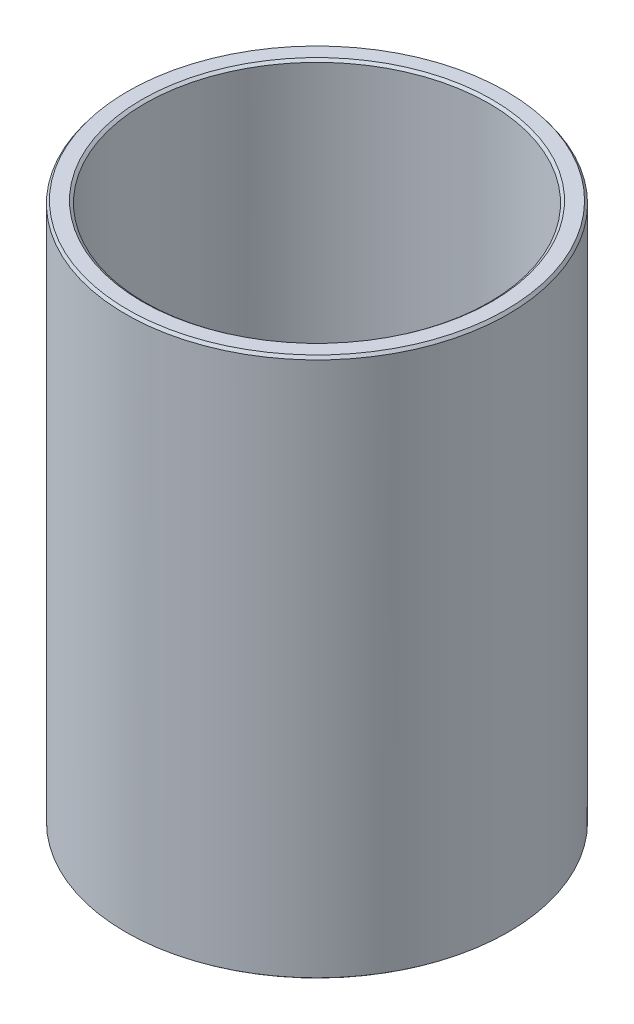
ISO-10303-21;
HEADER;
FILE_DESCRIPTION(('STEP AP214'),'2;1');
FILE_NAME('part.step','',(''),(''),'','','');
FILE_SCHEMA(('AUTOMOTIVE_DESIGN { 1 0 10303 214 1 1 1 1 }'));
ENDSEC;
DATA;
#1=APPLICATION_CONTEXT('core data for automotive mechanical design processes');
#2=APPLICATION_PROTOCOL_DEFINITION('international standard','automotive_design',2000,#1);
#3=PRODUCT_CONTEXT('',#1,'mechanical');
#4=PRODUCT('Part','Part','',(#3));
#5=PRODUCT_RELATED_PRODUCT_CATEGORY('part','',(#4));
#6=PRODUCT_DEFINITION_FORMATION('','',#4);
#7=PRODUCT_DEFINITION_CONTEXT('part definition',#1,'design');
#8=PRODUCT_DEFINITION('design','',#6,#7);
#9=PRODUCT_DEFINITION_SHAPE('','',#8);
#10=(LENGTH_UNIT() NAMED_UNIT(*) SI_UNIT(.MILLI.,.METRE.));
#11=(NAMED_UNIT(*) PLANE_ANGLE_UNIT() SI_UNIT($,.RADIAN.));
#12=(NAMED_UNIT(*) SI_UNIT($,.STERADIAN.) SOLID_ANGLE_UNIT());
#13=UNCERTAINTY_MEASURE_WITH_UNIT(LENGTH_MEASURE(1.E-05),#10,'distance_accuracy_value','');
#14=(GEOMETRIC_REPRESENTATION_CONTEXT(3) GLOBAL_UNCERTAINTY_ASSIGNED_CONTEXT((#13)) GLOBAL_UNIT_ASSIGNED_CONTEXT((#10,
#11,#12)) REPRESENTATION_CONTEXT('',''));
#15=CARTESIAN_POINT('',(0.,0.,0.));
#16=DIRECTION('',(0.,0.,1.));
#17=DIRECTION('',(1.,0.,0.));
#18=AXIS2_PLACEMENT_3D('',#15,#16,#17);
#19=CARTESIAN_POINT('',(0.,155.24099224461,0.));
#20=DIRECTION('',(0.,-1.,0.));
#21=DIRECTION('',(0.,0.,-1.));
#22=AXIS2_PLACEMENT_3D('',#19,#20,#21);
#23=CYLINDRICAL_SURFACE('',#22,55.);
#24=CARTESIAN_POINT('',(0.,0.613129846362109,0.));
#25=DIRECTION('',(0.,1.,0.));
#26=DIRECTION('',(0.,0.,1.));
#27=AXIS2_PLACEMENT_3D('',#24,#25,#26);
#28=CIRCLE('',#27,55.);
#29=CARTESIAN_POINT('',(0.,0.613129846362082,-55.));
#30=VERTEX_POINT('',#29);
#31=EDGE_CURVE('E10',#30,#30,#28,.T.);
#32=CARTESIAN_POINT('',(0.,154.433868409122,0.));
#33=DIRECTION('',(0.,1.,0.));
#34=DIRECTION('',(0.,0.,1.));
#35=AXIS2_PLACEMENT_3D('',#32,#33,#34);
#36=CIRCLE('',#35,55.);
#37=CARTESIAN_POINT('',(0.,154.433868409122,-55.));
#38=VERTEX_POINT('',#37);
#39=EDGE_CURVE('E50',#38,#38,#36,.F.);
#40=CARTESIAN_POINT('',(0.,0.613129846362082,-55.));
#41=CARTESIAN_POINT('',(0.,2.21542920639082,-55.));
#42=CARTESIAN_POINT('',(0.,3.81772856641956,-55.));
#43=CARTESIAN_POINT('',(0.,7.02232728647705,-55.));
#44=CARTESIAN_POINT('',(0.,8.6246266465058,-55.));
#45=CARTESIAN_POINT('',(0.,11.8292253665633,-55.));
#46=CARTESIAN_POINT('',(0.,13.431524726592,-55.));
#47=CARTESIAN_POINT('',(0.,16.6361234466495,-55.));
#48=CARTESIAN_POINT('',(0.,18.2384228066783,-55.));
#49=CARTESIAN_POINT('',(0.,21.4430215267358,-55.));
#50=CARTESIAN_POINT('',(0.,23.0453208867645,-55.));
#51=CARTESIAN_POINT('',(0.,26.249919606822,-55.));
#52=CARTESIAN_POINT('',(0.,27.8522189668507,-55.));
#53=CARTESIAN_POINT('',(0.,31.0568176869082,-55.));
#54=CARTESIAN_POINT('',(0.,32.659117046937,-55.));
#55=CARTESIAN_POINT('',(0.,35.8637157669944,-55.));
#56=CARTESIAN_POINT('',(0.,37.4660151270232,-55.));
#57=CARTESIAN_POINT('',(0.,40.6706138470807,-55.));
#58=CARTESIAN_POINT('',(0.,42.2729132071094,-55.));
#59=CARTESIAN_POINT('',(0.,45.4775119271669,-55.));
#60=CARTESIAN_POINT('',(0.,47.0798112871957,-55.));
#61=CARTESIAN_POINT('',(0.,50.2844100072531,-55.));
#62=CARTESIAN_POINT('',(0.,51.8867093672819,-55.));
#63=CARTESIAN_POINT('',(0.,55.0913080873394,-55.));
#64=CARTESIAN_POINT('',(0.,56.6936074473681,-55.));
#65=CARTESIAN_POINT('',(0.,59.8982061674256,-55.));
#66=CARTESIAN_POINT('',(0.,61.5005055274544,-55.));
#67=CARTESIAN_POINT('',(0.,64.7051042475118,-55.));
#68=CARTESIAN_POINT('',(0.,66.3074036075406,-55.));
#69=CARTESIAN_POINT('',(0.,69.5120023275981,-55.));
#70=CARTESIAN_POINT('',(0.,71.1143016876268,-55.));
#71=CARTESIAN_POINT('',(0.,74.3189004076843,-55.));
#72=CARTESIAN_POINT('',(0.,75.921199767713,-55.));
#73=CARTESIAN_POINT('',(0.,79.1257984877705,-55.));
#74=CARTESIAN_POINT('',(0.,80.7280978477993,-55.));
#75=CARTESIAN_POINT('',(0.,83.9326965678568,-55.));
#76=CARTESIAN_POINT('',(0.,85.5349959278855,-55.));
#77=CARTESIAN_POINT('',(0.,88.739594647943,-55.));
#78=CARTESIAN_POINT('',(0.,90.3418940079718,-55.));
#79=CARTESIAN_POINT('',(0.,93.5464927280292,-55.));
#80=CARTESIAN_POINT('',(0.,95.148792088058,-55.));
#81=CARTESIAN_POINT('',(0.,98.3533908081155,-55.));
#82=CARTESIAN_POINT('',(0.,99.9556901681442,-55.));
#83=CARTESIAN_POINT('',(0.,103.160288888202,-55.));
#84=CARTESIAN_POINT('',(0.,104.76258824823,-55.));
#85=CARTESIAN_POINT('',(0.,107.967186968288,-55.));
#86=CARTESIAN_POINT('',(0.,109.569486328317,-55.));
#87=CARTESIAN_POINT('',(0.,112.774085048374,-55.));
#88=CARTESIAN_POINT('',(0.,114.376384408403,-55.));
#89=CARTESIAN_POINT('',(0.,117.58098312846,-55.));
#90=CARTESIAN_POINT('',(0.,119.183282488489,-55.));
#91=CARTESIAN_POINT('',(0.,122.387881208547,-55.));
#92=CARTESIAN_POINT('',(0.,123.990180568575,-55.));
#93=CARTESIAN_POINT('',(0.,127.194779288633,-55.));
#94=CARTESIAN_POINT('',(0.,128.797078648662,-55.));
#95=CARTESIAN_POINT('',(0.,132.001677368719,-55.));
#96=CARTESIAN_POINT('',(0.,133.603976728748,-55.));
#97=CARTESIAN_POINT('',(0.,136.808575448805,-55.));
#98=CARTESIAN_POINT('',(0.,138.410874808834,-55.));
#99=CARTESIAN_POINT('',(0.,141.615473528892,-55.));
#100=CARTESIAN_POINT('',(0.,143.21777288892,-55.));
#101=CARTESIAN_POINT('',(0.,146.422371608978,-55.));
#102=CARTESIAN_POINT('',(0.,148.024670969007,-55.));
#103=CARTESIAN_POINT('',(0.,151.229269689064,-55.));
#104=CARTESIAN_POINT('',(0.,152.831569049093,-55.));
#105=CARTESIAN_POINT('',(0.,154.433868409122,-55.));
#106=B_SPLINE_CURVE_WITH_KNOTS('',3,(#40,#41,#42,#43,#44,#45,#46,#47,#48,#49,#50,#51,#52,#53,
#54,#55,#56,#57,#58,#59,#60,#61,#62,#63,#64,#65,#66,#67,#68,#69,#70,#71,#72,#73,#74,#75,#76,#77,
#78,#79,#80,#81,#82,#83,#84,#85,#86,#87,#88,#89,#90,#91,#92,#93,#94,#95,#96,#97,#98,#99,#100,
#101,#102,#103,#104,#105),.UNSPECIFIED.,.F.,.F.,(4,2,2,2,2,2,2,2,2,2,2,2,2,2,2,2,2,2,2,2,2,2,2,
2,2,2,2,2,2,2,2,2,4),(0.,4.80689808008622,9.61379616017247,14.4206942402587,19.2275923203449,
24.0344904004312,28.8413884805174,33.6482865606036,38.4551846406899,43.2620827207761,
48.0689808008623,52.8758788809485,57.6827769610348,62.489675041121,67.2965731212072,
72.1034712012935,76.9103692813797,81.717267361466,86.5241654415522,91.3310635216384,
96.1379616017246,100.944859681811,105.751757761897,110.558655841983,115.36555392207,
120.172452002156,124.979350082242,129.786248162328,134.593146242414,139.400044322501,
144.206942402587,149.013840482673,153.820738562759),.UNSPECIFIED.);
#107=EDGE_CURVE('BSEAM39',#30,#38,#106,.T.);
#108=ORIENTED_EDGE('',*,*,#31,.T.);
#109=ORIENTED_EDGE('',*,*,#39,.T.);
#110=ORIENTED_EDGE('',*,*,#107,.T.);
#111=ORIENTED_EDGE('',*,*,#107,.F.);
#112=EDGE_LOOP('',(#108,#110,#109,#111));
#113=FACE_BOUND('',#112,.T.);
#114=ADVANCED_FACE('F39',(#113),#23,.T.);
#115=CARTESIAN_POINT('',(0.,155.24099224461,0.));
#116=DIRECTION('',(0.,1.,0.));
#117=DIRECTION('',(0.,0.,1.));
#118=AXIS2_PLACEMENT_3D('',#115,#116,#117);
#119=PLANE('',#118);
#120=CARTESIAN_POINT('',(0.,155.24099224461,0.));
#121=DIRECTION('',(0.,1.,0.));
#122=DIRECTION('',(0.,0.,1.));
#123=AXIS2_PLACEMENT_3D('',#120,#121,#122);
#124=CIRCLE('',#123,50.3099960299566);
#125=CARTESIAN_POINT('',(0.,155.24099224461,50.3099960299566));
#126=VERTEX_POINT('',#125);
#127=EDGE_CURVE('E58',#126,#126,#124,.F.);
#128=ORIENTED_EDGE('',*,*,#127,.T.);
#129=EDGE_LOOP('',(#128));
#130=FACE_BOUND('',#129,.T.);
#131=CARTESIAN_POINT('',(0.,155.24099224461,0.));
#132=DIRECTION('',(0.,1.,0.));
#133=DIRECTION('',(0.,0.,1.));
#134=AXIS2_PLACEMENT_3D('',#131,#132,#133);
#135=CIRCLE('',#134,54.3868701536381);
#136=CARTESIAN_POINT('',(0.,155.24099224461,-54.3868701536381));
#137=VERTEX_POINT('',#136);
#138=EDGE_CURVE('E61',#137,#137,#135,.T.);
#139=ORIENTED_EDGE('',*,*,#138,.T.);
#140=EDGE_LOOP('',(#139));
#141=FACE_BOUND('',#140,.T.);
#142=ADVANCED_FACE('F88',(#130,#141),#119,.T.);
#143=CARTESIAN_POINT('',(0.,0.,0.));
#144=DIRECTION('',(0.,1.,0.));
#145=DIRECTION('',(0.,0.,1.));
#146=AXIS2_PLACEMENT_3D('',#143,#144,#145);
#147=PLANE('',#146);
#148=CARTESIAN_POINT('',(0.,0.,0.));
#149=DIRECTION('',(0.,1.,0.));
#150=DIRECTION('',(0.,0.,1.));
#151=AXIS2_PLACEMENT_3D('',#148,#149,#150);
#152=CIRCLE('',#151,50.1160020408298);
#153=CARTESIAN_POINT('',(0.,0.,50.1160020408298));
#154=VERTEX_POINT('',#153);
#155=EDGE_CURVE('E51',#154,#154,#152,.T.);
#156=ORIENTED_EDGE('',*,*,#155,.T.);
#157=EDGE_LOOP('',(#156));
#158=FACE_BOUND('',#157,.T.);
#159=CARTESIAN_POINT('',(0.,0.,0.));
#160=DIRECTION('',(0.,1.,0.));
#161=DIRECTION('',(0.,0.,1.));
#162=AXIS2_PLACEMENT_3D('',#159,#160,#161);
#163=CIRCLE('',#162,54.1928761645112);
#164=CARTESIAN_POINT('',(0.,0.,54.1928761645112));
#165=VERTEX_POINT('',#164);
#166=EDGE_CURVE('E54',#165,#165,#163,.F.);
#167=ORIENTED_EDGE('',*,*,#166,.T.);
#168=EDGE_LOOP('',(#167));
#169=FACE_BOUND('',#168,.T.);
#170=ADVANCED_FACE('F83',(#158,#169),#147,.F.);
#171=CARTESIAN_POINT('',(0.,155.24099224461,0.));
#172=DIRECTION('',(0.,-1.,0.));
#173=DIRECTION('',(0.,0.,-1.));
#174=AXIS2_PLACEMENT_3D('',#171,#172,#173);
#175=CYLINDRICAL_SURFACE('',#174,49.5028721944678);
#176=CARTESIAN_POINT('',(0.,154.627862398248,0.));
#177=DIRECTION('',(0.,1.,0.));
#178=DIRECTION('',(0.,0.,1.));
#179=AXIS2_PLACEMENT_3D('',#176,#177,#178);
#180=CIRCLE('',#179,49.5028721944678);
#181=CARTESIAN_POINT('',(0.,154.627862398248,-49.5028721944678));
#182=VERTEX_POINT('',#181);
#183=EDGE_CURVE('E67',#182,#182,#180,.T.);
#184=CARTESIAN_POINT('',(0.,0.807123835488616,0.));
#185=DIRECTION('',(0.,1.,0.));
#186=DIRECTION('',(0.,0.,1.));
#187=AXIS2_PLACEMENT_3D('',#184,#185,#186);
#188=CIRCLE('',#187,49.5028721944678);
#189=CARTESIAN_POINT('',(0.,0.807123835488588,-49.5028721944678));
#190=VERTEX_POINT('',#189);
#191=EDGE_CURVE('E69',#190,#190,#188,.F.);
#192=CARTESIAN_POINT('',(0.,154.627862398248,-49.5028721944678));
#193=CARTESIAN_POINT('',(0.,153.025563038219,-49.5028721944678));
#194=CARTESIAN_POINT('',(0.,151.423263678191,-49.5028721944678));
#195=CARTESIAN_POINT('',(0.,148.218664958133,-49.5028721944678));
#196=CARTESIAN_POINT('',(0.,146.616365598104,-49.5028721944678));
#197=CARTESIAN_POINT('',(0.,143.411766878047,-49.5028721944678));
#198=CARTESIAN_POINT('',(0.,141.809467518018,-49.5028721944678));
#199=CARTESIAN_POINT('',(0.,138.604868797961,-49.5028721944678));
#200=CARTESIAN_POINT('',(0.,137.002569437932,-49.5028721944678));
#201=CARTESIAN_POINT('',(0.,133.797970717874,-49.5028721944678));
#202=CARTESIAN_POINT('',(0.,132.195671357846,-49.5028721944678));
#203=CARTESIAN_POINT('',(0.,128.991072637788,-49.5028721944678));
#204=CARTESIAN_POINT('',(0.,127.388773277759,-49.5028721944678));
#205=CARTESIAN_POINT('',(0.,124.184174557702,-49.5028721944678));
#206=CARTESIAN_POINT('',(0.,122.581875197673,-49.5028721944678));
#207=CARTESIAN_POINT('',(0.,119.377276477616,-49.5028721944678));
#208=CARTESIAN_POINT('',(0.,117.774977117587,-49.5028721944678));
#209=CARTESIAN_POINT('',(0.,114.570378397529,-49.5028721944678));
#210=CARTESIAN_POINT('',(0.,112.968079037501,-49.5028721944678));
#211=CARTESIAN_POINT('',(0.,109.763480317443,-49.5028721944678));
#212=CARTESIAN_POINT('',(0.,108.161180957414,-49.5028721944678));
#213=CARTESIAN_POINT('',(0.,104.956582237357,-49.5028721944678));
#214=CARTESIAN_POINT('',(0.,103.354282877328,-49.5028721944678));
#215=CARTESIAN_POINT('',(0.,100.149684157271,-49.5028721944678));
#216=CARTESIAN_POINT('',(0.,98.547384797242,-49.5028721944678));
#217=CARTESIAN_POINT('',(0.,95.3427860771845,-49.5028721944678));
#218=CARTESIAN_POINT('',(0.,93.7404867171558,-49.5028721944678));
#219=CARTESIAN_POINT('',(0.,90.5358879970983,-49.5028721944678));
#220=CARTESIAN_POINT('',(0.,88.9335886370695,-49.5028721944678));
#221=CARTESIAN_POINT('',(0.,85.728989917012,-49.5028721944678));
#222=CARTESIAN_POINT('',(0.,84.1266905569833,-49.5028721944678));
#223=CARTESIAN_POINT('',(0.,80.9220918369258,-49.5028721944678));
#224=CARTESIAN_POINT('',(0.,79.3197924768971,-49.5028721944678));
#225=CARTESIAN_POINT('',(0.,76.1151937568396,-49.5028721944678));
#226=CARTESIAN_POINT('',(0.,74.5128943968108,-49.5028721944678));
#227=CARTESIAN_POINT('',(0.,71.3082956767533,-49.5028721944678));
#228=CARTESIAN_POINT('',(0.,69.7059963167246,-49.5028721944678));
#229=CARTESIAN_POINT('',(0.,66.5013975966671,-49.5028721944678));
#230=CARTESIAN_POINT('',(0.,64.8990982366384,-49.5028721944678));
#231=CARTESIAN_POINT('',(0.,61.6944995165809,-49.5028721944678));
#232=CARTESIAN_POINT('',(0.,60.0922001565521,-49.5028721944678));
#233=CARTESIAN_POINT('',(0.,56.8876014364946,-49.5028721944678));
#234=CARTESIAN_POINT('',(0.,55.2853020764659,-49.5028721944678));
#235=CARTESIAN_POINT('',(0.,52.0807033564084,-49.5028721944678));
#236=CARTESIAN_POINT('',(0.,50.4784039963797,-49.5028721944678));
#237=CARTESIAN_POINT('',(0.,47.2738052763222,-49.5028721944678));
#238=CARTESIAN_POINT('',(0.,45.6715059162934,-49.5028721944678));
#239=CARTESIAN_POINT('',(0.,42.4669071962359,-49.5028721944678));
#240=CARTESIAN_POINT('',(0.,40.8646078362072,-49.5028721944678));
#241=CARTESIAN_POINT('',(0.,37.6600091161497,-49.5028721944678));
#242=CARTESIAN_POINT('',(0.,36.057709756121,-49.5028721944678));
#243=CARTESIAN_POINT('',(0.,32.8531110360635,-49.5028721944678));
#244=CARTESIAN_POINT('',(0.,31.2508116760347,-49.5028721944678));
#245=CARTESIAN_POINT('',(0.,28.0462129559772,-49.5028721944678));
#246=CARTESIAN_POINT('',(0.,26.4439135959485,-49.5028721944678));
#247=CARTESIAN_POINT('',(0.,23.239314875891,-49.5028721944678));
#248=CARTESIAN_POINT('',(0.,21.6370155158623,-49.5028721944678));
#249=CARTESIAN_POINT('',(0.,18.4324167958048,-49.5028721944678));
#250=CARTESIAN_POINT('',(0.,16.830117435776,-49.5028721944678));
#251=CARTESIAN_POINT('',(0.,13.6255187157186,-49.5028721944678));
#252=CARTESIAN_POINT('',(0.,12.0232193556898,-49.5028721944678));
#253=CARTESIAN_POINT('',(0.,8.81862063563231,-49.5028721944678));
#254=CARTESIAN_POINT('',(0.,7.21632127560356,-49.5028721944678));
#255=CARTESIAN_POINT('',(0.,4.01172255554607,-49.5028721944678));
#256=CARTESIAN_POINT('',(0.,2.40942319551733,-49.5028721944678));
#257=CARTESIAN_POINT('',(0.,0.807123835488588,-49.5028721944678));
#258=B_SPLINE_CURVE_WITH_KNOTS('',3,(#192,#193,#194,#195,#196,#197,#198,#199,#200,#201,#202,
#203,#204,#205,#206,#207,#208,#209,#210,#211,#212,#213,#214,#215,#216,#217,#218,#219,#220,#221,
#222,#223,#224,#225,#226,#227,#228,#229,#230,#231,#232,#233,#234,#235,#236,#237,#238,#239,#240,
#241,#242,#243,#244,#245,#246,#247,#248,#249,#250,#251,#252,#253,#254,#255,#256,#257),
.UNSPECIFIED.,.F.,.F.,(4,2,2,2,2,2,2,2,2,2,2,2,2,2,2,2,2,2,2,2,2,2,2,2,2,2,2,2,2,2,2,2,4),(0.,
4.80689808008622,9.61379616017244,14.4206942402587,19.2275923203449,24.0344904004312,
28.8413884805174,33.6482865606036,38.4551846406898,43.2620827207761,48.0689808008623,
52.8758788809485,57.6827769610348,62.489675041121,67.2965731212072,72.1034712012935,
76.9103692813797,81.7172673614659,86.5241654415522,91.3310635216384,96.1379616017246,
100.944859681811,105.751757761897,110.558655841983,115.36555392207,120.172452002156,
124.979350082242,129.786248162328,134.593146242414,139.400044322501,144.206942402587,
149.013840482673,153.820738562759),.UNSPECIFIED.);
#259=EDGE_CURVE('BSEAM71',#182,#190,#258,.T.);
#260=ORIENTED_EDGE('',*,*,#183,.T.);
#261=ORIENTED_EDGE('',*,*,#191,.T.);
#262=ORIENTED_EDGE('',*,*,#259,.T.);
#263=ORIENTED_EDGE('',*,*,#259,.F.);
#264=EDGE_LOOP('',(#260,#262,#261,#263));
#265=FACE_BOUND('',#264,.T.);
#266=ADVANCED_FACE('F71',(#265),#175,.F.);
#267=CARTESIAN_POINT('',(0.,154.627862398248,0.));
#268=DIRECTION('',(0.,1.,0.));
#269=DIRECTION('',(0.,0.,1.));
#270=AXIS2_PLACEMENT_3D('',#267,#268,#269);
#271=CONICAL_SURFACE('',#270,49.5028721944678,0.921149165453213);
#272=ORIENTED_EDGE('',*,*,#127,.F.);
#273=EDGE_LOOP('',(#272));
#274=FACE_BOUND('',#273,.T.);
#275=ORIENTED_EDGE('',*,*,#183,.F.);
#276=EDGE_LOOP('',(#275));
#277=FACE_BOUND('',#276,.T.);
#278=ADVANCED_FACE('F77',(#274,#277),#271,.F.);
#279=CARTESIAN_POINT('',(0.,0.,0.));
#280=DIRECTION('',(0.,-1.,0.));
#281=DIRECTION('',(0.,0.,-1.));
#282=AXIS2_PLACEMENT_3D('',#279,#280,#281);
#283=CONICAL_SURFACE('',#282,50.1160020408298,0.649647161341695);
#284=ORIENTED_EDGE('',*,*,#191,.F.);
#285=EDGE_LOOP('',(#284));
#286=FACE_BOUND('',#285,.T.);
#287=ORIENTED_EDGE('',*,*,#155,.F.);
#288=EDGE_LOOP('',(#287));
#289=FACE_BOUND('',#288,.T.);
#290=ADVANCED_FACE('F73',(#286,#289),#283,.F.);
#291=CARTESIAN_POINT('',(0.,0.613129846362109,0.));
#292=DIRECTION('',(0.,1.,0.));
#293=DIRECTION('',(0.,0.,1.));
#294=AXIS2_PLACEMENT_3D('',#291,#292,#293);
#295=CONICAL_SURFACE('',#294,55.,0.921149165453194);
#296=ORIENTED_EDGE('',*,*,#166,.F.);
#297=EDGE_LOOP('',(#296));
#298=FACE_BOUND('',#297,.T.);
#299=ORIENTED_EDGE('',*,*,#31,.F.);
#300=EDGE_LOOP('',(#299));
#301=FACE_BOUND('',#300,.T.);
#302=ADVANCED_FACE('F76',(#298,#301),#295,.T.);
#303=CARTESIAN_POINT('',(0.,155.24099224461,0.));
#304=DIRECTION('',(0.,-1.,0.));
#305=DIRECTION('',(0.,0.,-1.));
#306=AXIS2_PLACEMENT_3D('',#303,#304,#305);
#307=CONICAL_SURFACE('',#306,54.3868701536381,0.64964716134169);
#308=CARTESIAN_POINT('',(0.,154.433868409122,-55.));
#309=CARTESIAN_POINT('',(0.,154.442275949075,-54.9936132307671));
#310=CARTESIAN_POINT('',(0.,154.450683489028,-54.9872264615341));
#311=CARTESIAN_POINT('',(0.,154.467498568934,-54.9744529230683));
#312=CARTESIAN_POINT('',(0.,154.475906108887,-54.9680661538353));
#313=CARTESIAN_POINT('',(0.,154.492721188793,-54.9552926153695));
#314=CARTESIAN_POINT('',(0.,154.501128728746,-54.9489058461365));
#315=CARTESIAN_POINT('',(0.,154.517943808652,-54.9361323076706));
#316=CARTESIAN_POINT('',(0.,154.526351348605,-54.9297455384377));
#317=CARTESIAN_POINT('',(0.,154.543166428511,-54.9169719999718));
#318=CARTESIAN_POINT('',(0.,154.551573968464,-54.9105852307389));
#319=CARTESIAN_POINT('',(0.,154.56838904837,-54.897811692273));
#320=CARTESIAN_POINT('',(0.,154.576796588323,-54.8914249230401));
#321=CARTESIAN_POINT('',(0.,154.593611668229,-54.8786513845742));
#322=CARTESIAN_POINT('',(0.,154.602019208182,-54.8722646153413));
#323=CARTESIAN_POINT('',(0.,154.618834288088,-54.8594910768754));
#324=CARTESIAN_POINT('',(0.,154.627241828041,-54.8531043076425));
#325=CARTESIAN_POINT('',(0.,154.644056907947,-54.8403307691766));
#326=CARTESIAN_POINT('',(0.,154.6524644479,-54.8339439999436));
#327=CARTESIAN_POINT('',(0.,154.669279527806,-54.8211704614778));
#328=CARTESIAN_POINT('',(0.,154.677687067759,-54.8147836922448));
#329=CARTESIAN_POINT('',(0.,154.694502147665,-54.802010153779));
#330=CARTESIAN_POINT('',(0.,154.702909687618,-54.795623384546));
#331=CARTESIAN_POINT('',(0.,154.719724767524,-54.7828498460802));
#332=CARTESIAN_POINT('',(0.,154.728132307477,-54.7764630768472));
#333=CARTESIAN_POINT('',(0.,154.744947387383,-54.7636895383813));
#334=CARTESIAN_POINT('',(0.,154.753354927336,-54.7573027691484));
#335=CARTESIAN_POINT('',(0.,154.770170007242,-54.7445292306825));
#336=CARTESIAN_POINT('',(0.,154.778577547195,-54.7381424614496));
#337=CARTESIAN_POINT('',(0.,154.795392627101,-54.7253689229837));
#338=CARTESIAN_POINT('',(0.,154.803800167054,-54.7189821537508));
#339=CARTESIAN_POINT('',(0.,154.82061524696,-54.7062086152849));
#340=CARTESIAN_POINT('',(0.,154.829022786913,-54.699821846052));
#341=CARTESIAN_POINT('',(0.,154.845837866819,-54.6870483075861));
#342=CARTESIAN_POINT('',(0.,154.854245406772,-54.6806615383532));
#343=CARTESIAN_POINT('',(0.,154.871060486678,-54.6678879998873));
#344=CARTESIAN_POINT('',(0.,154.879468026631,-54.6615012306544));
#345=CARTESIAN_POINT('',(0.,154.896283106537,-54.6487276921885));
#346=CARTESIAN_POINT('',(0.,154.90469064649,-54.6423409229555));
#347=CARTESIAN_POINT('',(0.,154.921505726396,-54.6295673844897));
#348=CARTESIAN_POINT('',(0.,154.929913266349,-54.6231806152567));
#349=CARTESIAN_POINT('',(0.,154.946728346255,-54.6104070767909));
#350=CARTESIAN_POINT('',(0.,154.955135886208,-54.6040203075579));
#351=CARTESIAN_POINT('',(0.,154.971950966114,-54.5912467690921));
#352=CARTESIAN_POINT('',(0.,154.980358506067,-54.5848599998591));
#353=CARTESIAN_POINT('',(0.,154.997173585973,-54.5720864613932));
#354=CARTESIAN_POINT('',(0.,155.005581125926,-54.5656996921603));
#355=CARTESIAN_POINT('',(0.,155.022396205832,-54.5529261536944));
#356=CARTESIAN_POINT('',(0.,155.030803745785,-54.5465393844615));
#357=CARTESIAN_POINT('',(0.,155.047618825691,-54.5337658459956));
#358=CARTESIAN_POINT('',(0.,155.056026365644,-54.5273790767627));
#359=CARTESIAN_POINT('',(0.,155.07284144555,-54.5146055382968));
#360=CARTESIAN_POINT('',(0.,155.081248985503,-54.5082187690639));
#361=CARTESIAN_POINT('',(0.,155.098064065409,-54.495445230598));
#362=CARTESIAN_POINT('',(0.,155.106471605362,-54.4890584613651));
#363=CARTESIAN_POINT('',(0.,155.123286685268,-54.4762849228992));
#364=CARTESIAN_POINT('',(0.,155.131694225221,-54.4698981536663));
#365=CARTESIAN_POINT('',(0.,155.148509305127,-54.4571246152004));
#366=CARTESIAN_POINT('',(0.,155.15691684508,-54.4507378459674));
#367=CARTESIAN_POINT('',(0.,155.173731924986,-54.4379643075016));
#368=CARTESIAN_POINT('',(0.,155.182139464939,-54.4315775382686));
#369=CARTESIAN_POINT('',(0.,155.198954544845,-54.4188039998028));
#370=CARTESIAN_POINT('',(0.,155.207362084798,-54.4124172305698));
#371=CARTESIAN_POINT('',(0.,155.224177164704,-54.399643692104));
#372=CARTESIAN_POINT('',(0.,155.232584704657,-54.393256922871));
#373=CARTESIAN_POINT('',(0.,155.24099224461,-54.3868701536381));
#374=B_SPLINE_CURVE_WITH_KNOTS('',3,(#308,#309,#310,#311,#312,#313,#314,#315,#316,#317,#318,
#319,#320,#321,#322,#323,#324,#325,#326,#327,#328,#329,#330,#331,#332,#333,#334,#335,#336,#337,
#338,#339,#340,#341,#342,#343,#344,#345,#346,#347,#348,#349,#350,#351,#352,#353,#354,#355,#356,
#357,#358,#359,#360,#361,#362,#363,#364,#365,#366,#367,#368,#369,#370,#371,#372,#373),
.UNSPECIFIED.,.F.,.F.,(4,2,2,2,2,2,2,2,2,2,2,2,2,2,2,2,2,2,2,2,2,2,2,2,2,2,2,2,2,2,2,2,4),(0.,
0.0316748787474732,0.0633497574949202,0.0950246362423713,0.126699514989818,0.158374393737265,
0.190049272484716,0.221724151232163,0.25339902997961,0.285073908727061,0.316748787474508,
0.348423666221955,0.380098544969406,0.411773423716853,0.4434483024643,0.475123181211751,
0.506798059959198,0.538472938706645,0.570147817454096,0.601822696201543,0.63349757494899,
0.665172453696441,0.696847332443888,0.728522211191335,0.760197089938786,0.791871968686233,
0.82354684743368,0.855221726181131,0.886896604928578,0.918571483676025,0.950246362423476,
0.981921241170923,1.01359611991839),.UNSPECIFIED.);
#375=EDGE_CURVE('BSEAM45',#38,#137,#374,.T.);
#376=ORIENTED_EDGE('',*,*,#39,.F.);
#377=ORIENTED_EDGE('',*,*,#138,.F.);
#378=ORIENTED_EDGE('',*,*,#375,.T.);
#379=ORIENTED_EDGE('',*,*,#375,.F.);
#380=EDGE_LOOP('',(#376,#378,#377,#379));
#381=FACE_BOUND('',#380,.T.);
#382=ADVANCED_FACE('F45',(#381),#307,.T.);
#383=CLOSED_SHELL('',(#114,#142,#170,#266,#278,#290,#302,#382));
#384=MANIFOLD_SOLID_BREP('B2',#383);
#385=ADVANCED_BREP_SHAPE_REPRESENTATION('',(#18,#384),#14);
#386=SHAPE_DEFINITION_REPRESENTATION(#9,#385);
ENDSEC;
END-ISO-10303-21;
